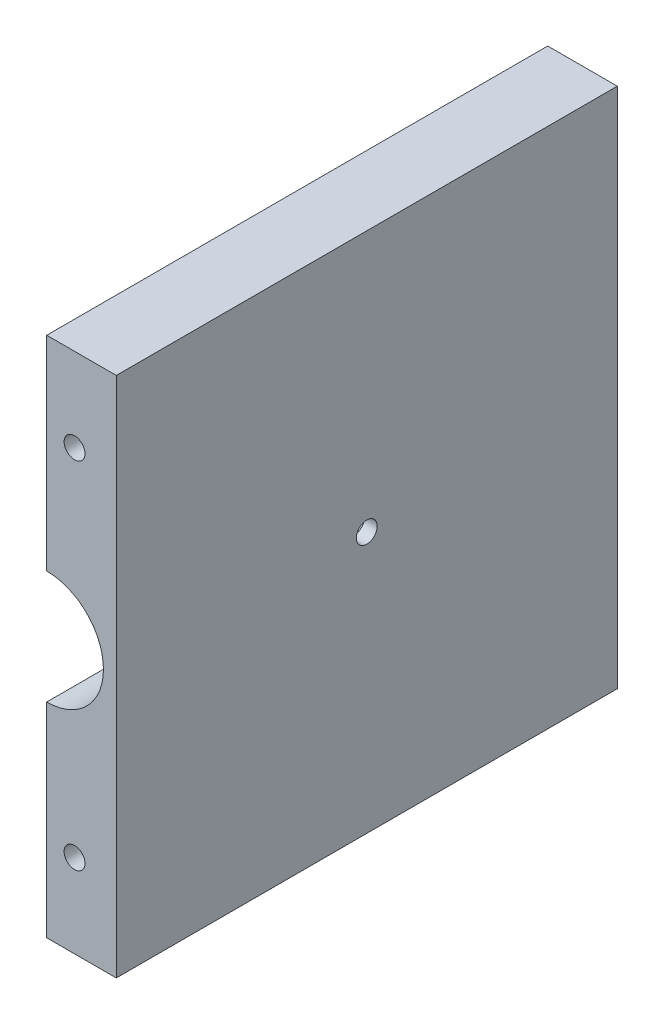
ISO-10303-21;
HEADER;
FILE_DESCRIPTION(('STEP AP214'),'2;1');
FILE_NAME('part.step','',(''),(''),'','','');
FILE_SCHEMA(('AUTOMOTIVE_DESIGN { 1 0 10303 214 1 1 1 1 }'));
ENDSEC;
DATA;
#1=APPLICATION_CONTEXT('core data for automotive mechanical design processes');
#2=APPLICATION_PROTOCOL_DEFINITION('international standard','automotive_design',2000,#1);
#3=PRODUCT_CONTEXT('',#1,'mechanical');
#4=PRODUCT('Part','Part','',(#3));
#5=PRODUCT_RELATED_PRODUCT_CATEGORY('part','',(#4));
#6=PRODUCT_DEFINITION_FORMATION('','',#4);
#7=PRODUCT_DEFINITION_CONTEXT('part definition',#1,'design');
#8=PRODUCT_DEFINITION('design','',#6,#7);
#9=PRODUCT_DEFINITION_SHAPE('','',#8);
#10=(LENGTH_UNIT() NAMED_UNIT(*) SI_UNIT(.MILLI.,.METRE.));
#11=(NAMED_UNIT(*) PLANE_ANGLE_UNIT() SI_UNIT($,.RADIAN.));
#12=(NAMED_UNIT(*) SI_UNIT($,.STERADIAN.) SOLID_ANGLE_UNIT());
#13=UNCERTAINTY_MEASURE_WITH_UNIT(LENGTH_MEASURE(1.E-05),#10,'distance_accuracy_value','');
#14=(GEOMETRIC_REPRESENTATION_CONTEXT(3) GLOBAL_UNCERTAINTY_ASSIGNED_CONTEXT((#13)) GLOBAL_UNIT_ASSIGNED_CONTEXT((#10,
#11,#12)) REPRESENTATION_CONTEXT('',''));
#15=CARTESIAN_POINT('',(0.,0.,0.));
#16=DIRECTION('',(0.,0.,1.));
#17=DIRECTION('',(1.,0.,0.));
#18=AXIS2_PLACEMENT_3D('',#15,#16,#17);
#19=CARTESIAN_POINT('',(0.,0.,72.));
#20=DIRECTION('',(0.,1.,0.));
#21=DIRECTION('',(0.,0.,1.));
#22=AXIS2_PLACEMENT_3D('',#19,#20,#21);
#23=PLANE('',#22);
#24=DIRECTION('',(1.,0.,0.));
#25=VECTOR('',#24,1.);
#26=CARTESIAN_POINT('',(0.,0.,0.));
#27=LINE('',#26,#25);
#28=CARTESIAN_POINT('',(0.,0.,0.));
#29=VERTEX_POINT('',#28);
#30=CARTESIAN_POINT('',(10.,0.,0.));
#31=VERTEX_POINT('',#30);
#32=EDGE_CURVE('E134',#29,#31,#27,.T.);
#33=ORIENTED_EDGE('',*,*,#32,.T.);
#34=DIRECTION('',(0.,0.,-1.));
#35=VECTOR('',#34,1.);
#36=CARTESIAN_POINT('',(10.,0.,72.));
#37=LINE('',#36,#35);
#38=CARTESIAN_POINT('',(10.,0.,72.));
#39=VERTEX_POINT('',#38);
#40=EDGE_CURVE('E11',#39,#31,#37,.T.);
#41=ORIENTED_EDGE('',*,*,#40,.F.);
#42=DIRECTION('',(1.,0.,0.));
#43=VECTOR('',#42,1.);
#44=CARTESIAN_POINT('',(0.,0.,72.));
#45=LINE('',#44,#43);
#46=CARTESIAN_POINT('',(0.,0.,72.));
#47=VERTEX_POINT('',#46);
#48=EDGE_CURVE('E155',#47,#39,#45,.T.);
#49=ORIENTED_EDGE('',*,*,#48,.F.);
#50=DIRECTION('',(0.,0.,-1.));
#51=VECTOR('',#50,1.);
#52=CARTESIAN_POINT('',(0.,0.,72.));
#53=LINE('',#52,#51);
#54=EDGE_CURVE('E62',#47,#29,#53,.T.);
#55=ORIENTED_EDGE('',*,*,#54,.T.);
#56=EDGE_LOOP('',(#33,#41,#49,#55));
#57=FACE_BOUND('',#56,.T.);
#58=ADVANCED_FACE('F39',(#57),#23,.F.);
#59=CARTESIAN_POINT('',(10.,0.,72.));
#60=DIRECTION('',(-1.,0.,0.));
#61=DIRECTION('',(0.,-1.,0.));
#62=AXIS2_PLACEMENT_3D('',#59,#60,#61);
#63=PLANE('',#62);
#64=CARTESIAN_POINT('',(9.99999999999999,37.5,36.));
#65=DIRECTION('',(1.,0.,0.));
#66=DIRECTION('',(0.,1.,0.));
#67=AXIS2_PLACEMENT_3D('',#64,#65,#66);
#68=CIRCLE('',#67,1.5);
#69=CARTESIAN_POINT('',(9.99999999999999,39.,36.));
#70=VERTEX_POINT('',#69);
#71=EDGE_CURVE('E207',#70,#70,#68,.T.);
#72=ORIENTED_EDGE('',*,*,#71,.F.);
#73=EDGE_LOOP('',(#72));
#74=FACE_BOUND('',#73,.T.);
#75=DIRECTION('',(0.,1.,0.));
#76=VECTOR('',#75,1.);
#77=CARTESIAN_POINT('',(10.,0.,0.));
#78=LINE('',#77,#76);
#79=CARTESIAN_POINT('',(9.99999999999998,75.,0.));
#80=VERTEX_POINT('',#79);
#81=EDGE_CURVE('E137',#31,#80,#78,.T.);
#82=ORIENTED_EDGE('',*,*,#81,.T.);
#83=DIRECTION('',(0.,0.,-1.));
#84=VECTOR('',#83,1.);
#85=CARTESIAN_POINT('',(9.99999999999998,75.,72.));
#86=LINE('',#85,#84);
#87=CARTESIAN_POINT('',(9.99999999999998,75.,72.));
#88=VERTEX_POINT('',#87);
#89=EDGE_CURVE('E54',#88,#80,#86,.T.);
#90=ORIENTED_EDGE('',*,*,#89,.F.);
#91=DIRECTION('',(0.,1.,0.));
#92=VECTOR('',#91,1.);
#93=CARTESIAN_POINT('',(10.,0.,72.));
#94=LINE('',#93,#92);
#95=EDGE_CURVE('E94',#39,#88,#94,.T.);
#96=ORIENTED_EDGE('',*,*,#95,.F.);
#97=ORIENTED_EDGE('',*,*,#40,.T.);
#98=EDGE_LOOP('',(#82,#90,#96,#97));
#99=FACE_BOUND('',#98,.T.);
#100=ADVANCED_FACE('F166',(#74,#99),#63,.F.);
#101=CARTESIAN_POINT('',(0.,75.,72.));
#102=DIRECTION('',(0.,1.,0.));
#103=DIRECTION('',(0.,0.,1.));
#104=AXIS2_PLACEMENT_3D('',#101,#102,#103);
#105=PLANE('',#104);
#106=DIRECTION('',(1.,0.,0.));
#107=VECTOR('',#106,1.);
#108=CARTESIAN_POINT('',(0.,75.,0.));
#109=LINE('',#108,#107);
#110=CARTESIAN_POINT('',(0.,75.,0.));
#111=VERTEX_POINT('',#110);
#112=EDGE_CURVE('E142',#111,#80,#109,.T.);
#113=ORIENTED_EDGE('',*,*,#112,.F.);
#114=DIRECTION('',(0.,0.,-1.));
#115=VECTOR('',#114,1.);
#116=CARTESIAN_POINT('',(0.,75.,72.));
#117=LINE('',#116,#115);
#118=CARTESIAN_POINT('',(0.,75.,72.));
#119=VERTEX_POINT('',#118);
#120=EDGE_CURVE('E124',#119,#111,#117,.T.);
#121=ORIENTED_EDGE('',*,*,#120,.F.);
#122=DIRECTION('',(1.,0.,0.));
#123=VECTOR('',#122,1.);
#124=CARTESIAN_POINT('',(0.,75.,72.));
#125=LINE('',#124,#123);
#126=EDGE_CURVE('E112',#119,#88,#125,.T.);
#127=ORIENTED_EDGE('',*,*,#126,.T.);
#128=ORIENTED_EDGE('',*,*,#89,.T.);
#129=EDGE_LOOP('',(#113,#121,#127,#128));
#130=FACE_BOUND('',#129,.T.);
#131=ADVANCED_FACE('F165',(#130),#105,.T.);
#132=CARTESIAN_POINT('',(0.,75.,72.));
#133=DIRECTION('',(1.,0.,0.));
#134=DIRECTION('',(0.,1.,0.));
#135=AXIS2_PLACEMENT_3D('',#132,#133,#134);
#136=PLANE('',#135);
#137=DIRECTION('',(0.,-1.,0.));
#138=VECTOR('',#137,1.);
#139=CARTESIAN_POINT('',(0.,75.,0.));
#140=LINE('',#139,#138);
#141=CARTESIAN_POINT('',(0.,45.65,0.));
#142=VERTEX_POINT('',#141);
#143=EDGE_CURVE('E120',#111,#142,#140,.T.);
#144=ORIENTED_EDGE('',*,*,#143,.T.);
#145=DIRECTION('',(0.,0.,-1.));
#146=VECTOR('',#145,1.);
#147=CARTESIAN_POINT('',(0.,45.65,72.));
#148=LINE('',#147,#146);
#149=CARTESIAN_POINT('',(0.,45.65,72.));
#150=VERTEX_POINT('',#149);
#151=EDGE_CURVE('E117',#150,#142,#148,.T.);
#152=ORIENTED_EDGE('',*,*,#151,.F.);
#153=DIRECTION('',(0.,-1.,0.));
#154=VECTOR('',#153,1.);
#155=CARTESIAN_POINT('',(0.,75.,72.));
#156=LINE('',#155,#154);
#157=EDGE_CURVE('E105',#119,#150,#156,.T.);
#158=ORIENTED_EDGE('',*,*,#157,.F.);
#159=ORIENTED_EDGE('',*,*,#120,.T.);
#160=EDGE_LOOP('',(#144,#152,#158,#159));
#161=FACE_BOUND('',#160,.T.);
#162=ADVANCED_FACE('F118',(#161),#136,.F.);
#163=CARTESIAN_POINT('',(0.,37.5,72.));
#164=DIRECTION('',(0.,0.,-1.));
#165=DIRECTION('',(-1.,0.,0.));
#166=AXIS2_PLACEMENT_3D('',#163,#164,#165);
#167=CYLINDRICAL_SURFACE('',#166,8.15);
#168=CARTESIAN_POINT('',(8.0107739950644,39.,36.));
#169=CARTESIAN_POINT('',(8.01077559560687,38.9999967691045,35.9165135299158));
#170=CARTESIAN_POINT('',(8.01209327838585,38.9930063688247,35.8329848080241));
#171=CARTESIAN_POINT('',(8.01721538148294,38.965247148634,35.6682806506992));
#172=CARTESIAN_POINT('',(8.02102194309986,38.9444664640667,35.5871073045679));
#173=CARTESIAN_POINT('',(8.03067640959897,38.8897847604136,35.429520942188));
#174=CARTESIAN_POINT('',(8.03652244647121,38.8558957445209,35.3531036449664));
#175=CARTESIAN_POINT('',(8.04959495249939,38.7759908466398,35.2070446366274));
#176=CARTESIAN_POINT('',(8.05682130572265,38.7299759829773,35.1374023572175));
#177=CARTESIAN_POINT('',(8.07193704409997,38.6265371704563,35.0060291561418));
#178=CARTESIAN_POINT('',(8.07983272034701,38.5689959203578,34.944391303573));
#179=CARTESIAN_POINT('',(8.09534184256046,38.4443912411579,34.831587082792));
#180=CARTESIAN_POINT('',(8.10295527029438,38.3773271982566,34.7804213900913));
#181=CARTESIAN_POINT('',(8.11710932846286,38.2349707170752,34.6896584934307));
#182=CARTESIAN_POINT('',(8.1236416849809,38.1596215602805,34.6501488485832));
#183=CARTESIAN_POINT('',(8.13482723191359,38.0032148345652,34.5843834660043));
#184=CARTESIAN_POINT('',(8.1394805711797,37.9221577184137,34.5581266783705));
#185=CARTESIAN_POINT('',(8.14633934690772,37.7575999750094,34.5198996076344));
#186=CARTESIAN_POINT('',(8.14857163278147,37.6741369130853,34.5077725122189));
#187=CARTESIAN_POINT('',(8.15042927608629,37.5063329548223,34.4976606364708));
#188=CARTESIAN_POINT('',(8.15005484774682,37.4219921311898,34.4996746939659));
#189=CARTESIAN_POINT('',(8.14676227963057,37.2559016171044,34.5176673365481));
#190=CARTESIAN_POINT('',(8.14387489465977,37.1741329393673,34.5334770892126));
#191=CARTESIAN_POINT('',(8.13591529528864,37.0144292180498,34.5783455222456));
#192=CARTESIAN_POINT('',(8.13084300343058,36.9364943104906,34.6074046723243));
#193=CARTESIAN_POINT('',(8.11903193853379,36.7861785562789,34.6781090769448));
#194=CARTESIAN_POINT('',(8.11228421831504,36.7138303558014,34.7198221807931));
#195=CARTESIAN_POINT('',(8.09786913297516,36.5770972844008,34.8146004691206));
#196=CARTESIAN_POINT('',(8.09020167765015,36.5127131958254,34.8676667674755));
#197=CARTESIAN_POINT('',(8.07466325935966,36.3927361208236,34.9845765137169));
#198=CARTESIAN_POINT('',(8.06679096347158,36.3372871208446,35.0485676464606));
#199=CARTESIAN_POINT('',(8.05183865883917,36.2378872971016,35.1850176523388));
#200=CARTESIAN_POINT('',(8.04475866086856,36.1939366296819,35.2574766405924));
#201=CARTESIAN_POINT('',(8.03219083905823,36.1187422500134,35.4089922532315));
#202=CARTESIAN_POINT('',(8.0267055627631,36.087518837729,35.4880591771382));
#203=CARTESIAN_POINT('',(8.01798774652025,36.0388394612751,35.6504401701113));
#204=CARTESIAN_POINT('',(8.01475496134027,36.0213819983576,35.7337537757747));
#205=CARTESIAN_POINT('',(8.01095649670136,36.0009389983933,35.9009665237363));
#206=CARTESIAN_POINT('',(8.01035274793223,35.9977468765601,35.9848395703781));
#207=CARTESIAN_POINT('',(8.01177892405548,36.0053719603077,36.1519204168954));
#208=CARTESIAN_POINT('',(8.01380872370574,36.0161884996869,36.2351282482169));
#209=CARTESIAN_POINT('',(8.02023787791458,36.0513467221363,36.3978415320822));
#210=CARTESIAN_POINT('',(8.0246183462874,36.075580653272,36.4773710801839));
#211=CARTESIAN_POINT('',(8.03523907261718,36.1367716479778,36.6312408031341));
#212=CARTESIAN_POINT('',(8.04147946326284,36.1737296193228,36.7055806072738));
#213=CARTESIAN_POINT('',(8.05520389851407,36.259797153408,36.8478723290613));
#214=CARTESIAN_POINT('',(8.06270102758863,36.3090375455188,36.9157438266574));
#215=CARTESIAN_POINT('',(8.07805714779351,36.4180952067831,37.0423354553272));
#216=CARTESIAN_POINT('',(8.08591617017717,36.4779133907137,37.1010547940868));
#217=CARTESIAN_POINT('',(8.10123256745549,36.6073500151026,37.2084440473968));
#218=CARTESIAN_POINT('',(8.10868348838645,36.6770844443338,37.2569752249482));
#219=CARTESIAN_POINT('',(8.12223647947568,36.8238368387416,37.3416326717023));
#220=CARTESIAN_POINT('',(8.12833860021445,36.9008545306385,37.3777594061043));
#221=CARTESIAN_POINT('',(8.13847864077806,37.0595988992221,37.4363733419508));
#222=CARTESIAN_POINT('',(8.14252697172638,37.1412994404022,37.4589294465288));
#223=CARTESIAN_POINT('',(8.14814764122251,37.3074105663764,37.4899821058407));
#224=CARTESIAN_POINT('',(8.14972023037516,37.3918208759936,37.4984800836009));
#225=CARTESIAN_POINT('',(8.15020749486995,37.5596234923658,37.5011272037586));
#226=CARTESIAN_POINT('',(8.1491610335968,37.6430124494165,37.4954861496136));
#227=CARTESIAN_POINT('',(8.14460828813323,37.8076329660718,37.4704738483471));
#228=CARTESIAN_POINT('',(8.1411020256971,37.8888645447496,37.4511027226533));
#229=CARTESIAN_POINT('',(8.1320233306466,38.0467588489535,37.3992672323801));
#230=CARTESIAN_POINT('',(8.12645430165902,38.123428860674,37.3668244287642));
#231=CARTESIAN_POINT('',(8.1138538016286,38.2702686364155,37.289791329446));
#232=CARTESIAN_POINT('',(8.10682223743175,38.3404379859748,37.2452002599218));
#233=CARTESIAN_POINT('',(8.09195052697216,38.4733321071438,37.1444104532264));
#234=CARTESIAN_POINT('',(8.08410054634344,38.5359405510528,37.0880597684081));
#235=CARTESIAN_POINT('',(8.0685398247818,38.6508856984205,36.9656663464413));
#236=CARTESIAN_POINT('',(8.06082911698921,38.7032199856073,36.8996213357524));
#237=CARTESIAN_POINT('',(8.04634545371433,38.7965655336844,36.7590145301681));
#238=CARTESIAN_POINT('',(8.03958141421721,38.8374723391168,36.684382445945));
#239=CARTESIAN_POINT('',(8.02786383660186,38.906102545262,36.5292059827637));
#240=CARTESIAN_POINT('',(8.02290857310146,38.9338385172074,36.4486673266095));
#241=CARTESIAN_POINT('',(8.01641435242833,38.9696351322341,36.3065642307886));
#242=CARTESIAN_POINT('',(8.01431163792272,38.9810026629468,36.245837035461));
#243=CARTESIAN_POINT('',(8.01149088526897,38.9961861948661,36.1234142406722));
#244=CARTESIAN_POINT('',(8.01077281183859,39.0000023884895,36.0617186659268));
#245=CARTESIAN_POINT('',(8.0107739950644,39.,36.));
#246=B_SPLINE_CURVE_WITH_KNOTS('',3,(#168,#169,#170,#171,#172,#173,#174,#175,#176,#177,#178,
#179,#180,#181,#182,#183,#184,#185,#186,#187,#188,#189,#190,#191,#192,#193,#194,#195,#196,#197,
#198,#199,#200,#201,#202,#203,#204,#205,#206,#207,#208,#209,#210,#211,#212,#213,#214,#215,#216,
#217,#218,#219,#220,#221,#222,#223,#224,#225,#226,#227,#228,#229,#230,#231,#232,#233,#234,#235,
#236,#237,#238,#239,#240,#241,#242,#243,#244,#245),.UNSPECIFIED.,.T.,.F.,(4,2,2,2,2,2,2,2,2,2,2,
2,2,2,2,2,2,2,2,2,2,2,2,2,2,2,2,2,2,2,2,2,2,2,2,2,2,2,4),(0.,0.250233579780017,
0.500682730991271,0.750903088786593,1.00110243982244,1.25399074154464,1.50689535080742,
1.76165401802726,2.0163924998865,2.26827610476841,2.52013900916425,2.76896215913982,
3.01779413094006,3.26798463355134,3.5181996939231,3.77211268385665,4.02602912609773,
4.28034899493119,4.53464117123016,4.78523860350619,5.03582411870449,5.2844258324803,
5.53304528599568,5.78443539420349,6.03584725349924,6.29048771078806,6.54511861734587,
6.79844551113506,7.05174676047638,7.30131169103048,7.55087441447939,7.80002717313284,
8.04919580606433,8.30180905990948,8.55448165225373,8.80939344403044,9.06406143735906,
9.24905520038012,9.43404424948655),.UNSPECIFIED.);
#247=CARTESIAN_POINT('',(8.0107739950644,39.,36.));
#248=VERTEX_POINT('',#247);
#249=EDGE_CURVE('E42',#248,#248,#246,.T.);
#250=ORIENTED_EDGE('',*,*,#249,.F.);
#251=EDGE_LOOP('',(#250));
#252=FACE_BOUND('',#251,.T.);
#253=CARTESIAN_POINT('',(0.,37.5,0.));
#254=DIRECTION('',(0.,0.,1.));
#255=DIRECTION('',(1.,0.,0.));
#256=AXIS2_PLACEMENT_3D('',#253,#254,#255);
#257=CIRCLE('',#256,8.15);
#258=CARTESIAN_POINT('',(0.,29.35,0.));
#259=VERTEX_POINT('',#258);
#260=EDGE_CURVE('E148',#259,#142,#257,.T.);
#261=ORIENTED_EDGE('',*,*,#260,.F.);
#262=DIRECTION('',(0.,0.,-1.));
#263=VECTOR('',#262,1.);
#264=CARTESIAN_POINT('',(0.,29.35,72.));
#265=LINE('',#264,#263);
#266=CARTESIAN_POINT('',(0.,29.35,72.));
#267=VERTEX_POINT('',#266);
#268=EDGE_CURVE('E82',#267,#259,#265,.T.);
#269=ORIENTED_EDGE('',*,*,#268,.F.);
#270=CARTESIAN_POINT('',(0.,37.5,72.));
#271=DIRECTION('',(0.,0.,1.));
#272=DIRECTION('',(1.,0.,0.));
#273=AXIS2_PLACEMENT_3D('',#270,#271,#272);
#274=CIRCLE('',#273,8.15);
#275=EDGE_CURVE('E110',#267,#150,#274,.T.);
#276=ORIENTED_EDGE('',*,*,#275,.T.);
#277=ORIENTED_EDGE('',*,*,#151,.T.);
#278=EDGE_LOOP('',(#261,#269,#276,#277));
#279=FACE_BOUND('',#278,.T.);
#280=ADVANCED_FACE('F126',(#252,#279),#167,.F.);
#281=CARTESIAN_POINT('',(0.,0.,72.));
#282=DIRECTION('',(-1.,0.,0.));
#283=DIRECTION('',(0.,0.,1.));
#284=AXIS2_PLACEMENT_3D('',#281,#282,#283);
#285=PLANE('',#284);
#286=DIRECTION('',(0.,1.,0.));
#287=VECTOR('',#286,1.);
#288=CARTESIAN_POINT('',(0.,0.,0.));
#289=LINE('',#288,#287);
#290=EDGE_CURVE('E151',#29,#259,#289,.T.);
#291=ORIENTED_EDGE('',*,*,#290,.F.);
#292=ORIENTED_EDGE('',*,*,#54,.F.);
#293=DIRECTION('',(0.,1.,0.));
#294=VECTOR('',#293,1.);
#295=CARTESIAN_POINT('',(0.,0.,72.));
#296=LINE('',#295,#294);
#297=EDGE_CURVE('E128',#47,#267,#296,.T.);
#298=ORIENTED_EDGE('',*,*,#297,.T.);
#299=ORIENTED_EDGE('',*,*,#268,.T.);
#300=EDGE_LOOP('',(#291,#292,#298,#299));
#301=FACE_BOUND('',#300,.T.);
#302=ADVANCED_FACE('F170',(#301),#285,.T.);
#303=CARTESIAN_POINT('',(0.,37.5,72.));
#304=DIRECTION('',(0.,0.,1.));
#305=DIRECTION('',(1.,0.,0.));
#306=AXIS2_PLACEMENT_3D('',#303,#304,#305);
#307=PLANE('',#306);
#308=CARTESIAN_POINT('',(3.99999999999999,63.,72.));
#309=DIRECTION('',(0.,0.,1.));
#310=DIRECTION('',(1.,0.,0.));
#311=AXIS2_PLACEMENT_3D('',#308,#309,#310);
#312=CIRCLE('',#311,1.5);
#313=CARTESIAN_POINT('',(5.49999999999999,63.,72.));
#314=VERTEX_POINT('',#313);
#315=EDGE_CURVE('E200',#314,#314,#312,.T.);
#316=ORIENTED_EDGE('',*,*,#315,.F.);
#317=EDGE_LOOP('',(#316));
#318=FACE_BOUND('',#317,.T.);
#319=CARTESIAN_POINT('',(4.,12.,72.));
#320=DIRECTION('',(0.,0.,1.));
#321=DIRECTION('',(1.,0.,0.));
#322=AXIS2_PLACEMENT_3D('',#319,#320,#321);
#323=CIRCLE('',#322,1.5);
#324=CARTESIAN_POINT('',(5.5,12.,72.));
#325=VERTEX_POINT('',#324);
#326=EDGE_CURVE('E191',#325,#325,#323,.T.);
#327=ORIENTED_EDGE('',*,*,#326,.F.);
#328=EDGE_LOOP('',(#327));
#329=FACE_BOUND('',#328,.T.);
#330=ORIENTED_EDGE('',*,*,#48,.T.);
#331=ORIENTED_EDGE('',*,*,#95,.T.);
#332=ORIENTED_EDGE('',*,*,#126,.F.);
#333=ORIENTED_EDGE('',*,*,#157,.T.);
#334=ORIENTED_EDGE('',*,*,#275,.F.);
#335=ORIENTED_EDGE('',*,*,#297,.F.);
#336=EDGE_LOOP('',(#330,#331,#332,#333,#334,#335));
#337=FACE_BOUND('',#336,.T.);
#338=ADVANCED_FACE('F107',(#318,#329,#337),#307,.T.);
#339=CARTESIAN_POINT('',(0.,37.5,0.));
#340=DIRECTION('',(0.,0.,1.));
#341=DIRECTION('',(1.,0.,0.));
#342=AXIS2_PLACEMENT_3D('',#339,#340,#341);
#343=PLANE('',#342);
#344=CARTESIAN_POINT('',(3.99999999999999,63.,0.));
#345=DIRECTION('',(0.,0.,1.));
#346=DIRECTION('',(1.,0.,0.));
#347=AXIS2_PLACEMENT_3D('',#344,#345,#346);
#348=CIRCLE('',#347,1.5);
#349=CARTESIAN_POINT('',(5.49999999999999,63.,0.));
#350=VERTEX_POINT('',#349);
#351=EDGE_CURVE('E138',#350,#350,#348,.T.);
#352=ORIENTED_EDGE('',*,*,#351,.T.);
#353=EDGE_LOOP('',(#352));
#354=FACE_BOUND('',#353,.T.);
#355=CARTESIAN_POINT('',(4.,12.,0.));
#356=DIRECTION('',(0.,0.,1.));
#357=DIRECTION('',(1.,0.,0.));
#358=AXIS2_PLACEMENT_3D('',#355,#356,#357);
#359=CIRCLE('',#358,1.5);
#360=CARTESIAN_POINT('',(5.5,12.,0.));
#361=VERTEX_POINT('',#360);
#362=EDGE_CURVE('E196',#361,#361,#359,.T.);
#363=ORIENTED_EDGE('',*,*,#362,.T.);
#364=EDGE_LOOP('',(#363));
#365=FACE_BOUND('',#364,.T.);
#366=ORIENTED_EDGE('',*,*,#32,.F.);
#367=ORIENTED_EDGE('',*,*,#290,.T.);
#368=ORIENTED_EDGE('',*,*,#260,.T.);
#369=ORIENTED_EDGE('',*,*,#143,.F.);
#370=ORIENTED_EDGE('',*,*,#112,.T.);
#371=ORIENTED_EDGE('',*,*,#81,.F.);
#372=EDGE_LOOP('',(#366,#367,#368,#369,#370,#371));
#373=FACE_BOUND('',#372,.T.);
#374=ADVANCED_FACE('F169',(#354,#365,#373),#343,.F.);
#375=CARTESIAN_POINT('',(4.,12.,0.));
#376=DIRECTION('',(0.,0.,1.));
#377=DIRECTION('',(1.,0.,0.));
#378=AXIS2_PLACEMENT_3D('',#375,#376,#377);
#379=CYLINDRICAL_SURFACE('',#378,1.5);
#380=ORIENTED_EDGE('',*,*,#362,.F.);
#381=EDGE_LOOP('',(#380));
#382=FACE_BOUND('',#381,.T.);
#383=ORIENTED_EDGE('',*,*,#326,.T.);
#384=EDGE_LOOP('',(#383));
#385=FACE_BOUND('',#384,.T.);
#386=ADVANCED_FACE('F222',(#382,#385),#379,.F.);
#387=CARTESIAN_POINT('',(3.99999999999999,63.,0.));
#388=DIRECTION('',(0.,0.,1.));
#389=DIRECTION('',(1.,0.,0.));
#390=AXIS2_PLACEMENT_3D('',#387,#388,#389);
#391=CYLINDRICAL_SURFACE('',#390,1.5);
#392=ORIENTED_EDGE('',*,*,#351,.F.);
#393=EDGE_LOOP('',(#392));
#394=FACE_BOUND('',#393,.T.);
#395=ORIENTED_EDGE('',*,*,#315,.T.);
#396=EDGE_LOOP('',(#395));
#397=FACE_BOUND('',#396,.T.);
#398=ADVANCED_FACE('F218',(#394,#397),#391,.F.);
#399=CARTESIAN_POINT('',(0.,37.5,36.));
#400=DIRECTION('',(1.,0.,0.));
#401=DIRECTION('',(0.,1.,0.));
#402=AXIS2_PLACEMENT_3D('',#399,#400,#401);
#403=CYLINDRICAL_SURFACE('',#402,1.5);
#404=ORIENTED_EDGE('',*,*,#249,.T.);
#405=EDGE_LOOP('',(#404));
#406=FACE_BOUND('',#405,.T.);
#407=ORIENTED_EDGE('',*,*,#71,.T.);
#408=EDGE_LOOP('',(#407));
#409=FACE_BOUND('',#408,.T.);
#410=ADVANCED_FACE('F216',(#406,#409),#403,.F.);
#411=CLOSED_SHELL('',(#58,#100,#131,#162,#280,#302,#338,#374,#386,#398,#410));
#412=MANIFOLD_SOLID_BREP('B2',#411);
#413=ADVANCED_BREP_SHAPE_REPRESENTATION('',(#18,#412),#14);
#414=SHAPE_DEFINITION_REPRESENTATION(#9,#413);
ENDSEC;
END-ISO-10303-21;
